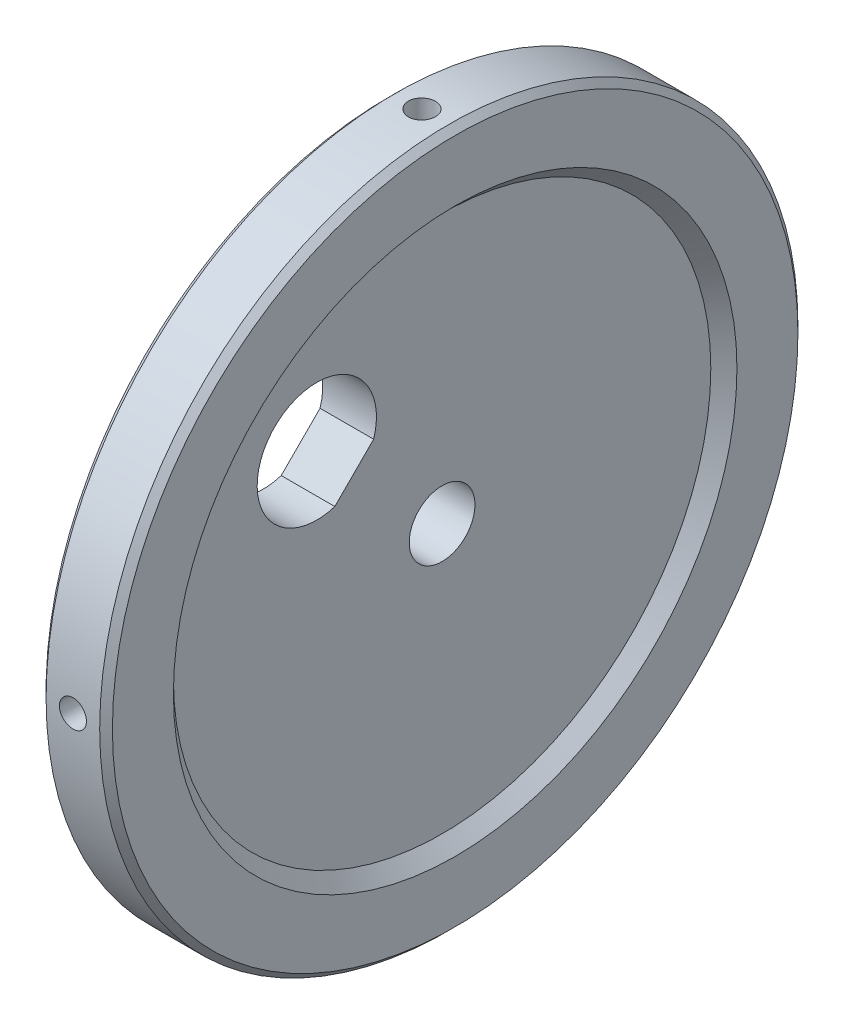
ISO-10303-21;
HEADER;
FILE_DESCRIPTION(('STEP AP214'),'2;1');
FILE_NAME('part.step','',(''),(''),'','','');
FILE_SCHEMA(('AUTOMOTIVE_DESIGN { 1 0 10303 214 1 1 1 1 }'));
ENDSEC;
DATA;
#1=APPLICATION_CONTEXT('core data for automotive mechanical design processes');
#2=APPLICATION_PROTOCOL_DEFINITION('international standard','automotive_design',2000,#1);
#3=PRODUCT_CONTEXT('',#1,'mechanical');
#4=PRODUCT('Part','Part','',(#3));
#5=PRODUCT_RELATED_PRODUCT_CATEGORY('part','',(#4));
#6=PRODUCT_DEFINITION_FORMATION('','',#4);
#7=PRODUCT_DEFINITION_CONTEXT('part definition',#1,'design');
#8=PRODUCT_DEFINITION('design','',#6,#7);
#9=PRODUCT_DEFINITION_SHAPE('','',#8);
#10=(LENGTH_UNIT() NAMED_UNIT(*) SI_UNIT(.MILLI.,.METRE.));
#11=(NAMED_UNIT(*) PLANE_ANGLE_UNIT() SI_UNIT($,.RADIAN.));
#12=(NAMED_UNIT(*) SI_UNIT($,.STERADIAN.) SOLID_ANGLE_UNIT());
#13=UNCERTAINTY_MEASURE_WITH_UNIT(LENGTH_MEASURE(1.E-05),#10,'distance_accuracy_value','');
#14=(GEOMETRIC_REPRESENTATION_CONTEXT(3) GLOBAL_UNCERTAINTY_ASSIGNED_CONTEXT((#13)) GLOBAL_UNIT_ASSIGNED_CONTEXT((#10,
#11,#12)) REPRESENTATION_CONTEXT('',''));
#15=CARTESIAN_POINT('',(0.,0.,0.));
#16=DIRECTION('',(0.,0.,1.));
#17=DIRECTION('',(1.,0.,0.));
#18=AXIS2_PLACEMENT_3D('',#15,#16,#17);
#19=CARTESIAN_POINT('',(8.,0.,0.));
#20=DIRECTION('',(1.,0.,0.));
#21=DIRECTION('',(0.,0.,-1.));
#22=AXIS2_PLACEMENT_3D('',#19,#20,#21);
#23=CONICAL_SURFACE('',#22,40.0992,0.785398163397455);
#24=CARTESIAN_POINT('',(8.,0.,0.));
#25=DIRECTION('',(-1.,0.,0.));
#26=DIRECTION('',(0.,0.,1.));
#27=AXIS2_PLACEMENT_3D('',#24,#25,#26);
#28=CIRCLE('',#27,40.0992);
#29=CARTESIAN_POINT('',(8.,0.,40.0992));
#30=VERTEX_POINT('',#29);
#31=EDGE_CURVE('E115',#30,#30,#28,.T.);
#32=ORIENTED_EDGE('',*,*,#31,.T.);
#33=EDGE_LOOP('',(#32));
#34=FACE_BOUND('',#33,.T.);
#35=CARTESIAN_POINT('',(9.9492,0.,0.));
#36=DIRECTION('',(1.,0.,0.));
#37=DIRECTION('',(0.,0.,-1.));
#38=AXIS2_PLACEMENT_3D('',#35,#36,#37);
#39=CIRCLE('',#38,42.0484);
#40=CARTESIAN_POINT('',(9.9492,0.,-42.0484));
#41=VERTEX_POINT('',#40);
#42=EDGE_CURVE('E93',#41,#41,#39,.F.);
#43=ORIENTED_EDGE('',*,*,#42,.F.);
#44=EDGE_LOOP('',(#43));
#45=FACE_BOUND('',#44,.T.);
#46=ADVANCED_FACE('F42',(#34,#45),#23,.F.);
#47=CARTESIAN_POINT('',(8.99999999999998,0.,0.));
#48=DIRECTION('',(-1.,0.,0.));
#49=DIRECTION('',(0.,0.,1.));
#50=AXIS2_PLACEMENT_3D('',#47,#48,#49);
#51=CONICAL_SURFACE('',#50,52.0992,0.785398163397448);
#52=CARTESIAN_POINT('',(8.99999999999998,0.,0.));
#53=DIRECTION('',(-1.,0.,0.));
#54=DIRECTION('',(0.,0.,1.));
#55=AXIS2_PLACEMENT_3D('',#52,#53,#54);
#56=CIRCLE('',#55,52.0992);
#57=CARTESIAN_POINT('',(8.99999999999998,0.,52.0992));
#58=VERTEX_POINT('',#57);
#59=EDGE_CURVE('E261',#58,#58,#56,.T.);
#60=ORIENTED_EDGE('',*,*,#59,.F.);
#61=EDGE_LOOP('',(#60));
#62=FACE_BOUND('',#61,.T.);
#63=CARTESIAN_POINT('',(9.9492,0.,0.));
#64=DIRECTION('',(1.,0.,0.));
#65=DIRECTION('',(0.,0.,-1.));
#66=AXIS2_PLACEMENT_3D('',#63,#64,#65);
#67=CIRCLE('',#66,51.15);
#68=CARTESIAN_POINT('',(9.9492,0.,-51.15));
#69=VERTEX_POINT('',#68);
#70=EDGE_CURVE('E46',#69,#69,#67,.F.);
#71=ORIENTED_EDGE('',*,*,#70,.T.);
#72=EDGE_LOOP('',(#71));
#73=FACE_BOUND('',#72,.T.);
#74=ADVANCED_FACE('F173',(#62,#73),#51,.T.);
#75=CARTESIAN_POINT('',(0.,0.,0.));
#76=DIRECTION('',(-1.,0.,0.));
#77=DIRECTION('',(0.,0.,1.));
#78=AXIS2_PLACEMENT_3D('',#75,#76,#77);
#79=CYLINDRICAL_SURFACE('',#78,4.9022);
#80=CARTESIAN_POINT('',(8.,0.,0.));
#81=DIRECTION('',(-1.,0.,0.));
#82=DIRECTION('',(0.,0.,1.));
#83=AXIS2_PLACEMENT_3D('',#80,#81,#82);
#84=CIRCLE('',#83,4.9022);
#85=CARTESIAN_POINT('',(8.,0.,4.9022));
#86=VERTEX_POINT('',#85);
#87=EDGE_CURVE('E118',#86,#86,#84,.T.);
#88=ORIENTED_EDGE('',*,*,#87,.F.);
#89=EDGE_LOOP('',(#88));
#90=FACE_BOUND('',#89,.T.);
#91=CARTESIAN_POINT('',(0.,0.,0.));
#92=DIRECTION('',(-1.,0.,0.));
#93=DIRECTION('',(0.,0.,1.));
#94=AXIS2_PLACEMENT_3D('',#91,#92,#93);
#95=CIRCLE('',#94,4.9022);
#96=CARTESIAN_POINT('',(0.,0.,4.9022));
#97=VERTEX_POINT('',#96);
#98=EDGE_CURVE('E111',#97,#97,#95,.T.);
#99=ORIENTED_EDGE('',*,*,#98,.T.);
#100=EDGE_LOOP('',(#99));
#101=FACE_BOUND('',#100,.T.);
#102=ADVANCED_FACE('F178',(#90,#101),#79,.F.);
#103=CARTESIAN_POINT('',(8.,0.,-4.9022));
#104=DIRECTION('',(-1.,0.,0.));
#105=DIRECTION('',(0.,0.,1.));
#106=AXIS2_PLACEMENT_3D('',#103,#104,#105);
#107=PLANE('',#106);
#108=CARTESIAN_POINT('',(8.,18.7,18.7));
#109=DIRECTION('',(1.,0.,0.));
#110=DIRECTION('',(0.,0.,-1.));
#111=AXIS2_PLACEMENT_3D('',#108,#109,#110);
#112=CIRCLE('',#111,8.89999999999999);
#113=CARTESIAN_POINT('',(8.,16.0121317778642,10.2155810793884));
#114=VERTEX_POINT('',#113);
#115=CARTESIAN_POINT('',(8.,10.2155810793884,16.0121317778641));
#116=VERTEX_POINT('',#115);
#117=EDGE_CURVE('E106',#114,#116,#112,.T.);
#118=ORIENTED_EDGE('',*,*,#117,.F.);
#119=DIRECTION('',(0.,0.707106781186548,-0.707106781186547));
#120=VECTOR('',#119,1.);
#121=CARTESIAN_POINT('',(8.,10.2155810793884,16.0121317778641));
#122=LINE('',#121,#120);
#123=EDGE_CURVE('E58',#116,#114,#122,.T.);
#124=ORIENTED_EDGE('',*,*,#123,.F.);
#125=EDGE_LOOP('',(#118,#124));
#126=FACE_BOUND('',#125,.T.);
#127=ORIENTED_EDGE('',*,*,#31,.F.);
#128=EDGE_LOOP('',(#127));
#129=FACE_BOUND('',#128,.T.);
#130=ORIENTED_EDGE('',*,*,#87,.T.);
#131=EDGE_LOOP('',(#130));
#132=FACE_BOUND('',#131,.T.);
#133=ADVANCED_FACE('F168',(#126,#129,#132),#107,.F.);
#134=CARTESIAN_POINT('',(0.,0.,0.));
#135=DIRECTION('',(-1.,0.,0.));
#136=DIRECTION('',(0.,0.,1.));
#137=AXIS2_PLACEMENT_3D('',#134,#135,#136);
#138=CYLINDRICAL_SURFACE('',#137,52.0992);
#139=CARTESIAN_POINT('',(1.00000000000001,0.,0.));
#140=DIRECTION('',(1.,0.,0.));
#141=DIRECTION('',(0.,0.,-1.));
#142=AXIS2_PLACEMENT_3D('',#139,#140,#141);
#143=CIRCLE('',#142,52.0992);
#144=CARTESIAN_POINT('',(1.00000000000001,0.,-52.0992));
#145=VERTEX_POINT('',#144);
#146=EDGE_CURVE('E11',#145,#145,#143,.T.);
#147=ORIENTED_EDGE('',*,*,#146,.T.);
#148=EDGE_LOOP('',(#147));
#149=FACE_BOUND('',#148,.T.);
#150=ORIENTED_EDGE('',*,*,#59,.T.);
#151=EDGE_LOOP('',(#150));
#152=FACE_BOUND('',#151,.T.);
#153=CARTESIAN_POINT('',(5.,52.0600525177414,2.01930000000054));
#154=CARTESIAN_POINT('',(4.8866207468725,52.0600530450892,2.01929498620389));
#155=CARTESIAN_POINT('',(4.77316036736925,52.0604268826738,2.00971894677766));
#156=CARTESIAN_POINT('',(4.54936750251875,52.0618821635881,1.97165286754928));
#157=CARTESIAN_POINT('',(4.43903889699691,52.062964447807,1.94314035054842));
#158=CARTESIAN_POINT('',(4.22478396200789,52.0657138399297,1.86801703491167));
#159=CARTESIAN_POINT('',(4.12085448062682,52.0673806571663,1.82141523019927));
#160=CARTESIAN_POINT('',(3.9223222845253,52.0711109287094,1.71144944131902));
#161=CARTESIAN_POINT('',(3.82771732891231,52.0731742873648,1.648089498056));
#162=CARTESIAN_POINT('',(3.6504279577562,52.0774667273506,1.50635796041795));
#163=CARTESIAN_POINT('',(3.56775041573732,52.0796959031255,1.42797777027524));
#164=CARTESIAN_POINT('',(3.41672104808395,52.0840678775856,1.25844691832802));
#165=CARTESIAN_POINT('',(3.34836979827619,52.086210672796,1.16729574345592));
#166=CARTESIAN_POINT('',(3.22791785916365,52.0901689859155,0.974778894937061));
#167=CARTESIAN_POINT('',(3.17582199135989,52.091984406655,0.873410202450456));
#168=CARTESIAN_POINT('',(3.08939073143921,52.0950824903863,0.663357169035168));
#169=CARTESIAN_POINT('',(3.05505524435175,52.0963651562268,0.554672867228937));
#170=CARTESIAN_POINT('',(3.00513609953419,52.0982525783441,0.33313213193188));
#171=CARTESIAN_POINT('',(2.98954294335229,52.0988576779949,0.220277841671938));
#172=CARTESIAN_POINT('',(2.97752180285846,52.0993229172599,-0.00644800571511762));
#173=CARTESIAN_POINT('',(2.98109371408022,52.0991830609346,-0.120319557293894));
#174=CARTESIAN_POINT('',(3.00729337173398,52.0981744428392,-0.345783210723619));
#175=CARTESIAN_POINT('',(3.02991088211266,52.0973060726097,-0.457376504032904));
#176=CARTESIAN_POINT('',(3.09354385901612,52.0949387239473,-0.675181139498345));
#177=CARTESIAN_POINT('',(3.13455937987376,52.0934397436522,-0.781392465759484));
#178=CARTESIAN_POINT('',(3.23383581686673,52.0899794076385,-0.985451192834155));
#179=CARTESIAN_POINT('',(3.29210141396205,52.0880179264455,-1.08329631410409));
#180=CARTESIAN_POINT('',(3.4242206111948,52.0838535823695,-1.26782021161849));
#181=CARTESIAN_POINT('',(3.4980742749963,52.0816507185006,-1.35449894225535));
#182=CARTESIAN_POINT('',(3.65933108043952,52.0772500866206,-1.51428924305249));
#183=CARTESIAN_POINT('',(3.74674310207168,52.0750523229142,-1.58739185214346));
#184=CARTESIAN_POINT('',(3.93260404740633,52.0709111239022,-1.71788579237552));
#185=CARTESIAN_POINT('',(4.03105297327815,52.0689676886465,-1.7752771204285));
#186=CARTESIAN_POINT('',(4.2361983060788,52.0655544004731,-1.87271847045469));
#187=CARTESIAN_POINT('',(4.34289485949403,52.0640845559692,-1.91276818433945));
#188=CARTESIAN_POINT('',(4.56150438061203,52.0617845335306,-1.97438359233618));
#189=CARTESIAN_POINT('',(4.67341732469697,52.0609543527001,-1.99594937012779));
#190=CARTESIAN_POINT('',(4.89920482770161,52.0600277998664,-2.01997370443167));
#191=CARTESIAN_POINT('',(5.01307806284899,52.0599309507378,-2.02244468455957));
#192=CARTESIAN_POINT('',(5.23962222999887,52.0604807371642,-2.00824167411261));
#193=CARTESIAN_POINT('',(5.3522931643649,52.0611273712573,-1.99156772118064));
#194=CARTESIAN_POINT('',(5.57319966254625,52.0630907990412,-1.93955845187132));
#195=CARTESIAN_POINT('',(5.68143656117732,52.0644073894234,-1.904228796731));
#196=CARTESIAN_POINT('',(5.89044357751691,52.0675621482116,-1.81591673665492));
#197=CARTESIAN_POINT('',(5.9912136695534,52.0694003184108,-1.76293427102951));
#198=CARTESIAN_POINT('',(6.18248378100606,52.0733921983517,-1.64078859619578));
#199=CARTESIAN_POINT('',(6.27297845862743,52.0755460708942,-1.57161702757118));
#200=CARTESIAN_POINT('',(6.44107524361355,52.0799259894302,-1.41906892407038));
#201=CARTESIAN_POINT('',(6.51867729947205,52.0821520357121,-1.33569233244755));
#202=CARTESIAN_POINT('',(6.65882757809871,52.086426767253,-1.15704766934583));
#203=CARTESIAN_POINT('',(6.72136778511572,52.0884753577022,-1.06177330677781));
#204=CARTESIAN_POINT('',(6.82956429170069,52.0921629164926,-0.862069552146122));
#205=CARTESIAN_POINT('',(6.875220642716,52.0938018860819,-0.75764018798015));
#206=CARTESIAN_POINT('',(6.94833936751069,52.0964850112921,-0.542620866292809));
#207=CARTESIAN_POINT('',(6.97580690923598,52.0975293358563,-0.432032668356704));
#208=CARTESIAN_POINT('',(7.01178524893219,52.0989061301443,-0.207810078038755));
#209=CARTESIAN_POINT('',(7.02029609749367,52.0992386017678,-0.0941756937872216));
#210=CARTESIAN_POINT('',(7.01811887845889,52.0991542270924,0.132833777724717));
#211=CARTESIAN_POINT('',(7.00744341226185,52.0987378726158,0.246208986243673));
#212=CARTESIAN_POINT('',(6.96722258054421,52.0972037103218,0.469556482071616));
#213=CARTESIAN_POINT('',(6.93767717824032,52.0960859011371,0.579528762746814));
#214=CARTESIAN_POINT('',(6.8605573849122,52.0932746804358,0.792952261997417));
#215=CARTESIAN_POINT('',(6.81298274026261,52.0915812608219,0.896403388812982));
#216=CARTESIAN_POINT('',(6.70115793118229,52.0878094902508,1.09384918343104));
#217=CARTESIAN_POINT('',(6.63690833539057,52.0857311524206,1.1878441735493));
#218=CARTESIAN_POINT('',(6.49351528900034,52.0814221382519,1.36377058900141));
#219=CARTESIAN_POINT('',(6.41436367402569,52.0791913788349,1.44569535735035));
#220=CARTESIAN_POINT('',(6.2434071684649,52.0748292754875,1.59511770967251));
#221=CARTESIAN_POINT('',(6.15159915720634,52.0726979562499,1.66261172496982));
#222=CARTESIAN_POINT('',(5.95788646398792,52.0687741007073,1.7812756701454));
#223=CARTESIAN_POINT('',(5.85597411619854,52.0669818246675,1.83243307985102));
#224=CARTESIAN_POINT('',(5.64507780982847,52.0639426382332,1.91685126877113));
#225=CARTESIAN_POINT('',(5.53610242753433,52.0626950801523,1.95013331324013));
#226=CARTESIAN_POINT('',(5.35536905442173,52.0612183093378,1.98906979987805));
#227=CARTESIAN_POINT('',(5.28478327524934,52.0607830475699,2.0003917823503));
#228=CARTESIAN_POINT('',(5.14280906097432,52.0601999857485,2.01550845968903));
#229=CARTESIAN_POINT('',(5.07142062627369,52.060052185551,2.01930315832526));
#230=CARTESIAN_POINT('',(5.,52.0600525177414,2.01930000000054));
#231=B_SPLINE_CURVE_WITH_KNOTS('',3,(#153,#154,#155,#156,#157,#158,#159,#160,#161,#162,#163,
#164,#165,#166,#167,#168,#169,#170,#171,#172,#173,#174,#175,#176,#177,#178,#179,#180,#181,#182,
#183,#184,#185,#186,#187,#188,#189,#190,#191,#192,#193,#194,#195,#196,#197,#198,#199,#200,#201,
#202,#203,#204,#205,#206,#207,#208,#209,#210,#211,#212,#213,#214,#215,#216,#217,#218,#219,#220,
#221,#222,#223,#224,#225,#226,#227,#228,#229,#230),.UNSPECIFIED.,.T.,.F.,(4,2,2,2,2,2,2,2,2,2,2,
2,2,2,2,2,2,2,2,2,2,2,2,2,2,2,2,2,2,2,2,2,2,2,2,2,2,2,4),(0.,0.3398770580213,0.680158265669201,
1.02027050308574,1.3603008035866,1.70052628046743,2.04076542964899,2.38110540127972,
2.72144355298315,3.06160915142128,3.40177289566254,3.74175393556873,4.08173597951105,
4.42181036526536,4.76188613996314,5.10218559376563,5.44248511445501,5.78279068060533,
6.1230947061318,6.46317730157388,6.80325922834464,7.14323801351931,7.48321796753938,
7.82337386267209,8.16353111670118,8.50386900063764,8.84420584751096,9.18444595369512,
9.52468515186438,9.86470096564277,10.2047174422182,10.5447387021337,10.8847483683747,
11.2249448608237,11.5652253856444,11.9057660748489,12.2459007407178,12.4599985039956,
12.6740961600513),.UNSPECIFIED.);
#232=CARTESIAN_POINT('',(5.,52.0600525177414,2.01930000000054));
#233=VERTEX_POINT('',#232);
#234=EDGE_CURVE('E255',#233,#233,#231,.T.);
#235=ORIENTED_EDGE('',*,*,#234,.T.);
#236=EDGE_LOOP('',(#235));
#237=FACE_BOUND('',#236,.T.);
#238=CARTESIAN_POINT('',(2.9807,0.,-52.0992));
#239=CARTESIAN_POINT('',(2.98070501376385,-0.113379289199854,-52.0991994741454));
#240=CARTESIAN_POINT('',(2.99028105907726,-0.226839704651487,-52.0988259247587));
#241=CARTESIAN_POINT('',(3.02834716381731,-0.450632644196927,-52.0973716731606));
#242=CARTESIAN_POINT('',(3.05685970032083,-0.560961288493453,-52.0962901306034));
#243=CARTESIAN_POINT('',(3.13198307301948,-0.775216305442052,-52.0935423483804));
#244=CARTESIAN_POINT('',(3.17858491622204,-0.879145829679516,-52.0918763992884));
#245=CARTESIAN_POINT('',(3.28855079571916,-1.07767809746716,-52.0881476104589));
#246=CARTESIAN_POINT('',(3.35191079101323,-1.1722830819643,-52.0860848664357));
#247=CARTESIAN_POINT('',(3.49364238100329,-1.34957242000901,-52.0817931354038));
#248=CARTESIAN_POINT('',(3.57202255986335,-1.43224990929976,-52.0795640537786));
#249=CARTESIAN_POINT('',(3.74155336717263,-1.5832791753285,-52.0751917037809));
#250=CARTESIAN_POINT('',(3.8327045088325,-1.65163037607827,-52.0730484388614));
#251=CARTESIAN_POINT('',(4.02522132874504,-1.77208226427676,-52.0690888271124));
#252=CARTESIAN_POINT('',(4.12659003154412,-1.82417812110665,-52.0672725775299));
#253=CARTESIAN_POINT('',(4.33664308738492,-1.91060935788658,-52.0641728415249));
#254=CARTESIAN_POINT('',(4.44532740124922,-1.94494483294059,-52.0628893522494));
#255=CARTESIAN_POINT('',(4.66686817146418,-1.99486395204049,-52.0610006504351));
#256=CARTESIAN_POINT('',(4.77972248477464,-2.01045709368167,-52.0603950943673));
#257=CARTESIAN_POINT('',(5.00644837714598,-2.02247819710955,-52.0599295090511));
#258=CARTESIAN_POINT('',(5.12031995065041,-2.01890626351558,-52.060069475733));
#259=CARTESIAN_POINT('',(5.34578350429339,-1.99270657085942,-52.0610788325293));
#260=CARTESIAN_POINT('',(5.45737667851556,-1.97008907035977,-52.061947829963));
#261=CARTESIAN_POINT('',(5.67518108089367,-1.90645615465727,-52.064316674707));
#262=CARTESIAN_POINT('',(5.78139229309028,-1.86544068490178,-52.0658165238879));
#263=CARTESIAN_POINT('',(5.98545088352293,-1.76616435285139,-52.0692784604796));
#264=CARTESIAN_POINT('',(6.08329597633979,-1.7078987975302,-52.0712406736507));
#265=CARTESIAN_POINT('',(6.26781983474721,-1.57577968899336,-52.0754060230612));
#266=CARTESIAN_POINT('',(6.35449855474935,-1.50192607214033,-52.0776091602841));
#267=CARTESIAN_POINT('',(6.5142889101353,-1.34066929948842,-52.0820097622879));
#268=CARTESIAN_POINT('',(6.58739157492686,-1.25325725424615,-52.0842072223786));
#269=CARTESIAN_POINT('',(6.7178856162171,-1.06739624201379,-52.08834736815));
#270=CARTESIAN_POINT('',(6.77527698973898,-0.968947272932541,-52.0902900537823));
#271=CARTESIAN_POINT('',(6.87271837229114,-0.763801929522281,-52.0937017240383));
#272=CARTESIAN_POINT('',(6.91276808746272,-0.657105415472671,-52.0951707006347));
#273=CARTESIAN_POINT('',(6.97438351014412,-0.438495979754545,-52.097469251256));
#274=CARTESIAN_POINT('',(6.99594930110131,-0.326583081638279,-52.0982988281674));
#275=CARTESIAN_POINT('',(7.0199736848836,-0.100795598264273,-52.0992247030253));
#276=CARTESIAN_POINT('',(7.02244468878413,0.013077664557498,-52.099321477272));
#277=CARTESIAN_POINT('',(7.00824171599964,0.239621892805347,-52.0987721017075));
#278=CARTESIAN_POINT('',(6.99156777696025,0.352292860595116,-52.0981259533571));
#279=CARTESIAN_POINT('',(6.93955850206635,0.573199516179375,-52.0961638442002));
#280=CARTESIAN_POINT('',(6.90422881346126,0.681436535488253,-52.0948480860945));
#281=CARTESIAN_POINT('',(6.81591664593062,0.890443778329162,-52.0916949741398));
#282=CARTESIAN_POINT('',(6.76293410651075,0.991213976271788,-52.0898576185034));
#283=CARTESIAN_POINT('',(6.64078832460532,1.18248415717511,-52.085866996215));
#284=CARTESIAN_POINT('',(6.57161674148298,1.27297881033533,-52.083713566935));
#285=CARTESIAN_POINT('',(6.4190686227463,1.44107553919149,-52.0793339669989));
#286=CARTESIAN_POINT('',(6.33569203027089,1.51867756327722,-52.0771077960517));
#287=CARTESIAN_POINT('',(6.15704738158549,1.65882777709757,-52.0728323018158));
#288=CARTESIAN_POINT('',(6.06177303433035,1.72136795112577,-52.0707830730637));
#289=CARTESIAN_POINT('',(5.86206931875696,1.82956439974603,-52.0670940035048));
#290=CARTESIAN_POINT('',(5.75763997833615,1.87522072578496,-52.0654541614505));
#291=CARTESIAN_POINT('',(5.54262063852826,1.9483394331891,-52.0627694393838));
#292=CARTESIAN_POINT('',(5.43203239505199,1.97580697170372,-52.0617243907388));
#293=CARTESIAN_POINT('',(5.20780970900095,2.01178528953384,-52.0603466150692));
#294=CARTESIAN_POINT('',(5.0941752745952,2.02029611968067,-52.0600138861346));
#295=CARTESIAN_POINT('',(4.86716583780286,2.018118848581,-52.0600983261785));
#296=CARTESIAN_POINT('',(4.75379071394361,2.00744337061282,-52.0605150020999));
#297=CARTESIAN_POINT('',(4.53044339027454,1.96722254521402,-52.0620502440303));
#298=CARTESIAN_POINT('',(4.42047119712599,1.93767716084791,-52.0631688114132));
#299=CARTESIAN_POINT('',(4.20704786744977,1.86055743457974,-52.0659816533717));
#300=CARTESIAN_POINT('',(4.10359682270137,1.81298283899892,-52.067675936048));
#301=CARTESIAN_POINT('',(3.9061511716229,1.70115815332432,-52.0714491595119));
#302=CARTESIAN_POINT('',(3.81215624302735,1.63690863178118,-52.073528087184));
#303=CARTESIAN_POINT('',(3.63622981960488,1.49351566521973,-52.0778377524744));
#304=CARTESIAN_POINT('',(3.55430499548744,1.41436403897868,-52.0800685730499));
#305=CARTESIAN_POINT('',(3.40488253592995,1.24340748819891,-52.0844302404222));
#306=CARTESIAN_POINT('',(3.33738846902258,1.15159944310797,-52.0865610623892));
#307=CARTESIAN_POINT('',(3.21872447038251,0.957886724208498,-52.0904835811696));
#308=CARTESIAN_POINT('',(3.16756704899224,0.855974390583557,-52.0922750176621));
#309=CARTESIAN_POINT('',(3.08314883426087,0.645078114611625,-52.0953125542212));
#310=CARTESIAN_POINT('',(3.04986677585147,0.53610274847327,-52.0965593019349));
#311=CARTESIAN_POINT('',(3.01093024860314,0.355369337861915,-52.0980350625457));
#312=CARTESIAN_POINT('',(2.9996082478959,0.284783502167719,-52.0984700094571));
#313=CARTESIAN_POINT('',(2.98449154632169,0.142809174566551,-52.0990526437375));
#314=CARTESIAN_POINT('',(2.98069684169445,0.0714206830605651,-52.09920033125));
#315=CARTESIAN_POINT('',(2.9807,0.,-52.0992));
#316=B_SPLINE_CURVE_WITH_KNOTS('',3,(#238,#239,#240,#241,#242,#243,#244,#245,#246,#247,#248,
#249,#250,#251,#252,#253,#254,#255,#256,#257,#258,#259,#260,#261,#262,#263,#264,#265,#266,#267,
#268,#269,#270,#271,#272,#273,#274,#275,#276,#277,#278,#279,#280,#281,#282,#283,#284,#285,#286,
#287,#288,#289,#290,#291,#292,#293,#294,#295,#296,#297,#298,#299,#300,#301,#302,#303,#304,#305,
#306,#307,#308,#309,#310,#311,#312,#313,#314,#315),.UNSPECIFIED.,.T.,.F.,(4,2,2,2,2,2,2,2,2,2,2,
2,2,2,2,2,2,2,2,2,2,2,2,2,2,2,2,2,2,2,2,2,2,2,2,2,2,2,4),(0.,0.339877166352468,
0.680158479974486,1.02027084095649,1.36030126312113,1.70052659829699,2.04076560960459,
2.38110563403806,2.72144383598685,3.06160950023442,3.40177330756956,3.74175400871313,
4.08173571795526,4.42181000712035,4.76188568464641,5.1021852791673,5.44248493816442,
5.7827903633982,6.1230942522839,6.46317693457754,6.80325894815133,7.1432380750568,
7.48321836704448,7.8233742048373,8.16353140426796,8.50386923255661,8.84420602379134,
9.18444627642759,9.52468561672774,9.86470118475809,10.2047174183286,10.5447384362516,
10.8847478622923,11.2249444999631,11.5652251666484,11.9057657934108,12.2459004004233,
12.4599983337861,12.6740961601959),.UNSPECIFIED.);
#317=CARTESIAN_POINT('',(2.9807,0.,-52.0992));
#318=VERTEX_POINT('',#317);
#319=EDGE_CURVE('E262',#318,#318,#316,.T.);
#320=ORIENTED_EDGE('',*,*,#319,.T.);
#321=EDGE_LOOP('',(#320));
#322=FACE_BOUND('',#321,.T.);
#323=CARTESIAN_POINT('',(5.,-52.0600525177415,-2.01930000000018));
#324=CARTESIAN_POINT('',(4.8866207468725,-52.0600530450892,-2.01929498620353));
#325=CARTESIAN_POINT('',(4.77316036736925,-52.0604268826738,-2.00971894677729));
#326=CARTESIAN_POINT('',(4.54936750251875,-52.0618821635881,-1.97165286754891));
#327=CARTESIAN_POINT('',(4.43903889699691,-52.062964447807,-1.94314035054806));
#328=CARTESIAN_POINT('',(4.22478396200789,-52.0657138399297,-1.86801703491131));
#329=CARTESIAN_POINT('',(4.12085448062682,-52.0673806571663,-1.82141523019891));
#330=CARTESIAN_POINT('',(3.9223222845253,-52.0711109287094,-1.71144944131866));
#331=CARTESIAN_POINT('',(3.82771732891231,-52.0731742873648,-1.64808949805564));
#332=CARTESIAN_POINT('',(3.6504279577562,-52.0774667273506,-1.50635796041758));
#333=CARTESIAN_POINT('',(3.56775041573732,-52.0796959031255,-1.42797777027488));
#334=CARTESIAN_POINT('',(3.41672104808395,-52.0840678775856,-1.25844691832766));
#335=CARTESIAN_POINT('',(3.34836979827619,-52.086210672796,-1.16729574345555));
#336=CARTESIAN_POINT('',(3.22791785916365,-52.0901689859155,-0.974778894936698));
#337=CARTESIAN_POINT('',(3.17582199135989,-52.0919844066551,-0.873410202450093));
#338=CARTESIAN_POINT('',(3.08939073143921,-52.0950824903863,-0.663357169034804));
#339=CARTESIAN_POINT('',(3.05505524435175,-52.0963651562268,-0.554672867228574));
#340=CARTESIAN_POINT('',(3.00513609953419,-52.0982525783441,-0.333132131931516));
#341=CARTESIAN_POINT('',(2.98954294335229,-52.0988576779949,-0.220277841671575));
#342=CARTESIAN_POINT('',(2.97752180285846,-52.0993229172599,0.00644800571548154));
#343=CARTESIAN_POINT('',(2.98109371408022,-52.0991830609346,0.120319557294258));
#344=CARTESIAN_POINT('',(3.00729337173398,-52.0981744428392,0.345783210723983));
#345=CARTESIAN_POINT('',(3.02991088211266,-52.0973060726097,0.457376504033268));
#346=CARTESIAN_POINT('',(3.09354385901612,-52.0949387239473,0.675181139498709));
#347=CARTESIAN_POINT('',(3.13455937987376,-52.0934397436522,0.781392465759848));
#348=CARTESIAN_POINT('',(3.23383581686673,-52.0899794076385,0.985451192834519));
#349=CARTESIAN_POINT('',(3.29210141396205,-52.0880179264455,1.08329631410445));
#350=CARTESIAN_POINT('',(3.4242206111948,-52.0838535823695,1.26782021161885));
#351=CARTESIAN_POINT('',(3.4980742749963,-52.0816507185006,1.35449894225572));
#352=CARTESIAN_POINT('',(3.65933108043952,-52.0772500866206,1.51428924305285));
#353=CARTESIAN_POINT('',(3.74674310207168,-52.0750523229142,1.58739185214383));
#354=CARTESIAN_POINT('',(3.93260404740633,-52.0709111239021,1.71788579237588));
#355=CARTESIAN_POINT('',(4.03105297327815,-52.0689676886465,1.77527712042886));
#356=CARTESIAN_POINT('',(4.2361983060788,-52.0655544004731,1.87271847045505));
#357=CARTESIAN_POINT('',(4.34289485949403,-52.0640845559692,1.91276818433981));
#358=CARTESIAN_POINT('',(4.56150438061203,-52.0617845335306,1.97438359233655));
#359=CARTESIAN_POINT('',(4.67341732469697,-52.0609543527,1.99594937012815));
#360=CARTESIAN_POINT('',(4.89920482770161,-52.0600277998664,2.01997370443203));
#361=CARTESIAN_POINT('',(5.01307806284899,-52.0599309507378,2.02244468455993));
#362=CARTESIAN_POINT('',(5.23962222999887,-52.0604807371642,2.00824167411297));
#363=CARTESIAN_POINT('',(5.3522931643649,-52.0611273712573,1.991567721181));
#364=CARTESIAN_POINT('',(5.57319966254625,-52.0630907990412,1.93955845187169));
#365=CARTESIAN_POINT('',(5.68143656117732,-52.0644073894234,1.90422879673137));
#366=CARTESIAN_POINT('',(5.89044357751691,-52.0675621482116,1.81591673665529));
#367=CARTESIAN_POINT('',(5.9912136695534,-52.0694003184108,1.76293427102988));
#368=CARTESIAN_POINT('',(6.18248378100606,-52.0733921983517,1.64078859619614));
#369=CARTESIAN_POINT('',(6.27297845862743,-52.0755460708942,1.57161702757154));
#370=CARTESIAN_POINT('',(6.44107524361355,-52.0799259894302,1.41906892407075));
#371=CARTESIAN_POINT('',(6.51867729947205,-52.0821520357121,1.33569233244792));
#372=CARTESIAN_POINT('',(6.65882757809871,-52.086426767253,1.15704766934619));
#373=CARTESIAN_POINT('',(6.72136778511572,-52.0884753577022,1.06177330677818));
#374=CARTESIAN_POINT('',(6.82956429170069,-52.0921629164926,0.862069552146486));
#375=CARTESIAN_POINT('',(6.875220642716,-52.0938018860819,0.757640187980514));
#376=CARTESIAN_POINT('',(6.94833936751069,-52.0964850112921,0.542620866293173));
#377=CARTESIAN_POINT('',(6.97580690923598,-52.0975293358563,0.432032668357068));
#378=CARTESIAN_POINT('',(7.01178524893219,-52.0989061301443,0.207810078039119));
#379=CARTESIAN_POINT('',(7.02029609749367,-52.0992386017678,0.0941756937875858));
#380=CARTESIAN_POINT('',(7.01811887845889,-52.0991542270924,-0.132833777724353));
#381=CARTESIAN_POINT('',(7.00744341226185,-52.0987378726158,-0.246208986243311));
#382=CARTESIAN_POINT('',(6.96722258054421,-52.0972037103218,-0.469556482071253));
#383=CARTESIAN_POINT('',(6.93767717824032,-52.0960859011371,-0.579528762746451));
#384=CARTESIAN_POINT('',(6.8605573849122,-52.0932746804358,-0.792952261997054));
#385=CARTESIAN_POINT('',(6.81298274026261,-52.0915812608219,-0.896403388812619));
#386=CARTESIAN_POINT('',(6.70115793118229,-52.0878094902508,-1.09384918343068));
#387=CARTESIAN_POINT('',(6.63690833539057,-52.0857311524206,-1.18784417354894));
#388=CARTESIAN_POINT('',(6.49351528900034,-52.0814221382519,-1.36377058900104));
#389=CARTESIAN_POINT('',(6.41436367402569,-52.0791913788349,-1.44569535734999));
#390=CARTESIAN_POINT('',(6.2434071684649,-52.0748292754875,-1.59511770967215));
#391=CARTESIAN_POINT('',(6.15159915720634,-52.0726979562499,-1.66261172496945));
#392=CARTESIAN_POINT('',(5.95788646398792,-52.0687741007073,-1.78127567014503));
#393=CARTESIAN_POINT('',(5.85597411619854,-52.0669818246675,-1.83243307985066));
#394=CARTESIAN_POINT('',(5.64507780982847,-52.0639426382332,-1.91685126877077));
#395=CARTESIAN_POINT('',(5.53610242753433,-52.0626950801523,-1.95013331323977));
#396=CARTESIAN_POINT('',(5.35536905442173,-52.0612183093378,-1.98906979987769));
#397=CARTESIAN_POINT('',(5.28478327524934,-52.0607830475699,-2.00039178234993));
#398=CARTESIAN_POINT('',(5.14280906097432,-52.0601999857485,-2.01550845968867));
#399=CARTESIAN_POINT('',(5.07142062627369,-52.060052185551,-2.01930315832489));
#400=CARTESIAN_POINT('',(5.,-52.0600525177415,-2.01930000000018));
#401=B_SPLINE_CURVE_WITH_KNOTS('',3,(#323,#324,#325,#326,#327,#328,#329,#330,#331,#332,#333,
#334,#335,#336,#337,#338,#339,#340,#341,#342,#343,#344,#345,#346,#347,#348,#349,#350,#351,#352,
#353,#354,#355,#356,#357,#358,#359,#360,#361,#362,#363,#364,#365,#366,#367,#368,#369,#370,#371,
#372,#373,#374,#375,#376,#377,#378,#379,#380,#381,#382,#383,#384,#385,#386,#387,#388,#389,#390,
#391,#392,#393,#394,#395,#396,#397,#398,#399,#400),.UNSPECIFIED.,.T.,.F.,(4,2,2,2,2,2,2,2,2,2,2,
2,2,2,2,2,2,2,2,2,2,2,2,2,2,2,2,2,2,2,2,2,2,2,2,2,2,2,4),(0.,0.339877058021299,
0.680158265669201,1.02027050308574,1.3603008035866,1.70052628046743,2.04076542964899,
2.38110540127972,2.72144355298315,3.06160915142128,3.40177289566254,3.74175393556873,
4.08173597951105,4.42181036526535,4.76188613996314,5.10218559376563,5.44248511445501,
5.78279068060533,6.1230947061318,6.46317730157388,6.80325922834464,7.14323801351931,
7.48321796753938,7.82337386267209,8.16353111670118,8.50386900063764,8.84420584751095,
9.18444595369512,9.52468515186438,9.86470096564277,10.2047174422182,10.5447387021337,
10.8847483683746,11.2249448608237,11.5652253856444,11.9057660748489,12.2459007407178,
12.4599985039956,12.6740961600513),.UNSPECIFIED.);
#402=CARTESIAN_POINT('',(5.,-52.0600525177415,-2.01930000000018));
#403=VERTEX_POINT('',#402);
#404=EDGE_CURVE('E135',#403,#403,#401,.T.);
#405=ORIENTED_EDGE('',*,*,#404,.T.);
#406=EDGE_LOOP('',(#405));
#407=FACE_BOUND('',#406,.T.);
#408=CARTESIAN_POINT('',(7.0193,0.,52.0992));
#409=CARTESIAN_POINT('',(7.01929498623615,-0.113379289199854,52.0991994741454));
#410=CARTESIAN_POINT('',(7.00971894092274,-0.226839704651487,52.0988259247587));
#411=CARTESIAN_POINT('',(6.97165283618269,-0.450632644196927,52.0973716731606));
#412=CARTESIAN_POINT('',(6.94314029967917,-0.560961288493453,52.0962901306034));
#413=CARTESIAN_POINT('',(6.86801692698052,-0.775216305442052,52.0935423483804));
#414=CARTESIAN_POINT('',(6.82141508377796,-0.879145829679517,52.0918763992884));
#415=CARTESIAN_POINT('',(6.71144920428084,-1.07767809746716,52.0881476104589));
#416=CARTESIAN_POINT('',(6.64808920898677,-1.1722830819643,52.0860848664357));
#417=CARTESIAN_POINT('',(6.50635761899671,-1.34957242000901,52.0817931354038));
#418=CARTESIAN_POINT('',(6.42797744013665,-1.43224990929976,52.0795640537786));
#419=CARTESIAN_POINT('',(6.25844663282737,-1.5832791753285,52.0751917037809));
#420=CARTESIAN_POINT('',(6.1672954911675,-1.65163037607827,52.0730484388614));
#421=CARTESIAN_POINT('',(5.97477867125496,-1.77208226427676,52.0690888271124));
#422=CARTESIAN_POINT('',(5.87340996845588,-1.82417812110665,52.0672725775299));
#423=CARTESIAN_POINT('',(5.66335691261508,-1.91060935788658,52.0641728415249));
#424=CARTESIAN_POINT('',(5.55467259875078,-1.94494483294059,52.0628893522494));
#425=CARTESIAN_POINT('',(5.33313182853582,-1.99486395204049,52.0610006504351));
#426=CARTESIAN_POINT('',(5.22027751522536,-2.01045709368167,52.0603950943673));
#427=CARTESIAN_POINT('',(4.99355162285402,-2.02247819710955,52.0599295090511));
#428=CARTESIAN_POINT('',(4.87968004934959,-2.01890626351558,52.060069475733));
#429=CARTESIAN_POINT('',(4.65421649570661,-1.99270657085942,52.0610788325293));
#430=CARTESIAN_POINT('',(4.54262332148444,-1.97008907035977,52.061947829963));
#431=CARTESIAN_POINT('',(4.32481891910633,-1.90645615465727,52.064316674707));
#432=CARTESIAN_POINT('',(4.21860770690972,-1.86544068490178,52.0658165238879));
#433=CARTESIAN_POINT('',(4.01454911647707,-1.76616435285139,52.0692784604796));
#434=CARTESIAN_POINT('',(3.91670402366021,-1.7078987975302,52.0712406736507));
#435=CARTESIAN_POINT('',(3.73218016525279,-1.57577968899336,52.0754060230612));
#436=CARTESIAN_POINT('',(3.64550144525065,-1.50192607214033,52.0776091602841));
#437=CARTESIAN_POINT('',(3.4857110898647,-1.34066929948842,52.0820097622879));
#438=CARTESIAN_POINT('',(3.41260842507314,-1.25325725424615,52.0842072223786));
#439=CARTESIAN_POINT('',(3.2821143837829,-1.06739624201379,52.08834736815));
#440=CARTESIAN_POINT('',(3.22472301026102,-0.968947272932541,52.0902900537823));
#441=CARTESIAN_POINT('',(3.12728162770886,-0.763801929522281,52.0937017240383));
#442=CARTESIAN_POINT('',(3.08723191253729,-0.657105415472671,52.0951707006347));
#443=CARTESIAN_POINT('',(3.02561648985588,-0.438495979754545,52.097469251256));
#444=CARTESIAN_POINT('',(3.00405069889869,-0.326583081638279,52.0982988281674));
#445=CARTESIAN_POINT('',(2.9800263151164,-0.100795598264273,52.0992247030253));
#446=CARTESIAN_POINT('',(2.97755531121587,0.013077664557498,52.099321477272));
#447=CARTESIAN_POINT('',(2.99175828400036,0.239621892805347,52.0987721017075));
#448=CARTESIAN_POINT('',(3.00843222303975,0.352292860595116,52.0981259533571));
#449=CARTESIAN_POINT('',(3.06044149793365,0.573199516179375,52.0961638442002));
#450=CARTESIAN_POINT('',(3.09577118653874,0.681436535488253,52.0948480860945));
#451=CARTESIAN_POINT('',(3.18408335406938,0.890443778329162,52.0916949741398));
#452=CARTESIAN_POINT('',(3.23706589348926,0.991213976271788,52.0898576185034));
#453=CARTESIAN_POINT('',(3.35921167539468,1.18248415717511,52.085866996215));
#454=CARTESIAN_POINT('',(3.42838325851702,1.27297881033533,52.083713566935));
#455=CARTESIAN_POINT('',(3.5809313772537,1.44107553919149,52.0793339669989));
#456=CARTESIAN_POINT('',(3.66430796972911,1.51867756327722,52.0771077960517));
#457=CARTESIAN_POINT('',(3.84295261841451,1.65882777709757,52.0728323018158));
#458=CARTESIAN_POINT('',(3.93822696566965,1.72136795112577,52.0707830730637));
#459=CARTESIAN_POINT('',(4.13793068124304,1.82956439974603,52.0670940035048));
#460=CARTESIAN_POINT('',(4.24236002166385,1.87522072578495,52.0654541614505));
#461=CARTESIAN_POINT('',(4.45737936147174,1.9483394331891,52.0627694393838));
#462=CARTESIAN_POINT('',(4.56796760494801,1.97580697170372,52.0617243907388));
#463=CARTESIAN_POINT('',(4.79219029099905,2.01178528953384,52.0603466150692));
#464=CARTESIAN_POINT('',(4.9058247254048,2.02029611968067,52.0600138861346));
#465=CARTESIAN_POINT('',(5.13283416219714,2.018118848581,52.0600983261785));
#466=CARTESIAN_POINT('',(5.2462092860564,2.00744337061282,52.0605150020999));
#467=CARTESIAN_POINT('',(5.46955660972546,1.96722254521402,52.0620502440303));
#468=CARTESIAN_POINT('',(5.57952880287401,1.93767716084791,52.0631688114132));
#469=CARTESIAN_POINT('',(5.79295213255023,1.86055743457974,52.0659816533717));
#470=CARTESIAN_POINT('',(5.89640317729863,1.81298283899892,52.067675936048));
#471=CARTESIAN_POINT('',(6.0938488283771,1.70115815332431,52.0714491595119));
#472=CARTESIAN_POINT('',(6.18784375697265,1.63690863178118,52.073528087184));
#473=CARTESIAN_POINT('',(6.36377018039512,1.49351566521973,52.0778377524744));
#474=CARTESIAN_POINT('',(6.44569500451256,1.41436403897868,52.0800685730499));
#475=CARTESIAN_POINT('',(6.59511746407005,1.24340748819891,52.0844302404222));
#476=CARTESIAN_POINT('',(6.66261153097742,1.15159944310797,52.0865610623892));
#477=CARTESIAN_POINT('',(6.78127552961749,0.957886724208499,52.0904835811696));
#478=CARTESIAN_POINT('',(6.83243295100775,0.855974390583557,52.0922750176621));
#479=CARTESIAN_POINT('',(6.91685116573913,0.645078114611626,52.0953125542212));
#480=CARTESIAN_POINT('',(6.95013322414854,0.53610274847327,52.0965593019349));
#481=CARTESIAN_POINT('',(6.98906975139686,0.355369337861915,52.0980350625457));
#482=CARTESIAN_POINT('',(7.0003917521041,0.28478350216772,52.0984700094571));
#483=CARTESIAN_POINT('',(7.01550845367831,0.142809174566552,52.0990526437375));
#484=CARTESIAN_POINT('',(7.01930315830555,0.0714206830605656,52.09920033125));
#485=CARTESIAN_POINT('',(7.0193,0.,52.0992));
#486=B_SPLINE_CURVE_WITH_KNOTS('',3,(#408,#409,#410,#411,#412,#413,#414,#415,#416,#417,#418,
#419,#420,#421,#422,#423,#424,#425,#426,#427,#428,#429,#430,#431,#432,#433,#434,#435,#436,#437,
#438,#439,#440,#441,#442,#443,#444,#445,#446,#447,#448,#449,#450,#451,#452,#453,#454,#455,#456,
#457,#458,#459,#460,#461,#462,#463,#464,#465,#466,#467,#468,#469,#470,#471,#472,#473,#474,#475,
#476,#477,#478,#479,#480,#481,#482,#483,#484,#485),.UNSPECIFIED.,.T.,.F.,(4,2,2,2,2,2,2,2,2,2,2,
2,2,2,2,2,2,2,2,2,2,2,2,2,2,2,2,2,2,2,2,2,2,2,2,2,2,2,4),(0.,0.339877166352468,
0.680158479974486,1.02027084095649,1.36030126312113,1.70052659829699,2.04076560960459,
2.38110563403806,2.72144383598685,3.06160950023442,3.40177330756956,3.74175400871313,
4.08173571795526,4.42181000712035,4.76188568464641,5.1021852791673,5.44248493816442,
5.7827903633982,6.1230942522839,6.46317693457754,6.80325894815133,7.1432380750568,
7.48321836704448,7.8233742048373,8.16353140426795,8.50386923255661,8.84420602379134,
9.18444627642758,9.52468561672774,9.86470118475809,10.2047174183286,10.5447384362516,
10.8847478622923,11.2249444999631,11.5652251666484,11.9057657934108,12.2459004004233,
12.4599983337861,12.6740961601959),.UNSPECIFIED.);
#487=CARTESIAN_POINT('',(7.0193,0.,52.0992));
#488=VERTEX_POINT('',#487);
#489=EDGE_CURVE('E127',#488,#488,#486,.T.);
#490=ORIENTED_EDGE('',*,*,#489,.T.);
#491=EDGE_LOOP('',(#490));
#492=FACE_BOUND('',#491,.T.);
#493=ADVANCED_FACE('F141',(#149,#152,#237,#322,#407,#492),#138,.T.);
#494=CARTESIAN_POINT('',(0.,0.,-4.9022));
#495=DIRECTION('',(1.,0.,0.));
#496=DIRECTION('',(0.,0.,-1.));
#497=AXIS2_PLACEMENT_3D('',#494,#495,#496);
#498=PLANE('',#497);
#499=CARTESIAN_POINT('',(0.,0.,0.));
#500=DIRECTION('',(1.,0.,0.));
#501=DIRECTION('',(0.,0.,-1.));
#502=AXIS2_PLACEMENT_3D('',#499,#500,#501);
#503=CIRCLE('',#502,51.0992);
#504=CARTESIAN_POINT('',(0.,0.,-51.0992));
#505=VERTEX_POINT('',#504);
#506=EDGE_CURVE('E51',#505,#505,#503,.F.);
#507=ORIENTED_EDGE('',*,*,#506,.T.);
#508=EDGE_LOOP('',(#507));
#509=FACE_BOUND('',#508,.T.);
#510=CARTESIAN_POINT('',(0.,18.7,18.7));
#511=DIRECTION('',(1.,0.,0.));
#512=DIRECTION('',(0.,0.,-1.));
#513=AXIS2_PLACEMENT_3D('',#510,#511,#512);
#514=CIRCLE('',#513,8.89999999999999);
#515=CARTESIAN_POINT('',(0.,16.0121317778642,10.2155810793884));
#516=VERTEX_POINT('',#515);
#517=CARTESIAN_POINT('',(0.,10.2155810793884,16.0121317778641));
#518=VERTEX_POINT('',#517);
#519=EDGE_CURVE('E121',#516,#518,#514,.T.);
#520=ORIENTED_EDGE('',*,*,#519,.T.);
#521=DIRECTION('',(0.,0.707106781186548,-0.707106781186547));
#522=VECTOR('',#521,1.);
#523=CARTESIAN_POINT('',(0.,15.5649564286263,10.6627564286263));
#524=LINE('',#523,#522);
#525=EDGE_CURVE('E124',#518,#516,#524,.T.);
#526=ORIENTED_EDGE('',*,*,#525,.T.);
#527=EDGE_LOOP('',(#520,#526));
#528=FACE_BOUND('',#527,.T.);
#529=ORIENTED_EDGE('',*,*,#98,.F.);
#530=EDGE_LOOP('',(#529));
#531=FACE_BOUND('',#530,.T.);
#532=ADVANCED_FACE('F161',(#509,#528,#531),#498,.F.);
#533=CARTESIAN_POINT('',(-2.,10.2155810793884,16.0121317778641));
#534=DIRECTION('',(0.,-0.707106781186547,-0.707106781186548));
#535=DIRECTION('',(0.,0.707106781186548,-0.707106781186547));
#536=AXIS2_PLACEMENT_3D('',#533,#534,#535);
#537=PLANE('',#536);
#538=DIRECTION('',(1.,0.,0.));
#539=VECTOR('',#538,1.);
#540=CARTESIAN_POINT('',(-2.,10.2155810793884,16.0121317778641));
#541=LINE('',#540,#539);
#542=EDGE_CURVE('E65',#518,#116,#541,.T.);
#543=ORIENTED_EDGE('',*,*,#542,.T.);
#544=ORIENTED_EDGE('',*,*,#123,.T.);
#545=DIRECTION('',(1.,0.,0.));
#546=VECTOR('',#545,1.);
#547=CARTESIAN_POINT('',(-2.,16.0121317778642,10.2155810793884));
#548=LINE('',#547,#546);
#549=EDGE_CURVE('E109',#516,#114,#548,.T.);
#550=ORIENTED_EDGE('',*,*,#549,.F.);
#551=ORIENTED_EDGE('',*,*,#525,.F.);
#552=EDGE_LOOP('',(#543,#544,#550,#551));
#553=FACE_BOUND('',#552,.T.);
#554=ADVANCED_FACE('F158',(#553),#537,.F.);
#555=CARTESIAN_POINT('',(-2.,18.7,18.7));
#556=DIRECTION('',(1.,0.,0.));
#557=DIRECTION('',(0.,0.,-1.));
#558=AXIS2_PLACEMENT_3D('',#555,#556,#557);
#559=CYLINDRICAL_SURFACE('',#558,8.89999999999999);
#560=ORIENTED_EDGE('',*,*,#549,.T.);
#561=ORIENTED_EDGE('',*,*,#117,.T.);
#562=ORIENTED_EDGE('',*,*,#542,.F.);
#563=ORIENTED_EDGE('',*,*,#519,.F.);
#564=EDGE_LOOP('',(#560,#561,#562,#563));
#565=FACE_BOUND('',#564,.T.);
#566=ADVANCED_FACE('F151',(#565),#559,.F.);
#567=CARTESIAN_POINT('',(5.,0.,52.0992));
#568=DIRECTION('',(0.,0.,1.));
#569=DIRECTION('',(1.,0.,0.));
#570=AXIS2_PLACEMENT_3D('',#567,#568,#569);
#571=CYLINDRICAL_SURFACE('',#570,2.0193);
#572=CARTESIAN_POINT('',(5.,0.,43.5992));
#573=DIRECTION('',(0.,0.,1.));
#574=DIRECTION('',(1.,0.,0.));
#575=AXIS2_PLACEMENT_3D('',#572,#573,#574);
#576=CIRCLE('',#575,2.0193);
#577=CARTESIAN_POINT('',(7.0193,0.,43.5992));
#578=VERTEX_POINT('',#577);
#579=EDGE_CURVE('E103',#578,#578,#576,.T.);
#580=ORIENTED_EDGE('',*,*,#579,.F.);
#581=EDGE_LOOP('',(#580));
#582=FACE_BOUND('',#581,.T.);
#583=ORIENTED_EDGE('',*,*,#489,.F.);
#584=EDGE_LOOP('',(#583));
#585=FACE_BOUND('',#584,.T.);
#586=ADVANCED_FACE('F145',(#582,#585),#571,.F.);
#587=CARTESIAN_POINT('',(5.,0.,43.5992));
#588=DIRECTION('',(0.,0.,1.));
#589=DIRECTION('',(1.,0.,0.));
#590=AXIS2_PLACEMENT_3D('',#587,#588,#589);
#591=CONICAL_SURFACE('',#590,2.0193,1.02974425867665);
#592=CARTESIAN_POINT('',(5.,0.,42.3858821519976));
#593=VERTEX_POINT('',#592);
#594=VERTEX_LOOP('',#593);
#595=FACE_BOUND('',#594,.T.);
#596=ORIENTED_EDGE('',*,*,#579,.T.);
#597=EDGE_LOOP('',(#596));
#598=FACE_BOUND('',#597,.T.);
#599=ADVANCED_FACE('F150',(#595,#598),#591,.F.);
#600=CARTESIAN_POINT('',(5.,-52.0992,-1.81903384568656E-13));
#601=DIRECTION('',(0.,-1.,0.));
#602=DIRECTION('',(0.,0.,-1.));
#603=AXIS2_PLACEMENT_3D('',#600,#601,#602);
#604=CYLINDRICAL_SURFACE('',#603,2.0193);
#605=CARTESIAN_POINT('',(5.,-43.5992,-1.81903384568656E-13));
#606=DIRECTION('',(0.,-1.,0.));
#607=DIRECTION('',(0.,0.,-1.));
#608=AXIS2_PLACEMENT_3D('',#605,#606,#607);
#609=CIRCLE('',#608,2.0193);
#610=CARTESIAN_POINT('',(5.,-43.5992,-2.01930000000018));
#611=VERTEX_POINT('',#610);
#612=EDGE_CURVE('E96',#611,#611,#609,.T.);
#613=ORIENTED_EDGE('',*,*,#612,.F.);
#614=EDGE_LOOP('',(#613));
#615=FACE_BOUND('',#614,.T.);
#616=ORIENTED_EDGE('',*,*,#404,.F.);
#617=EDGE_LOOP('',(#616));
#618=FACE_BOUND('',#617,.T.);
#619=ADVANCED_FACE('F156',(#615,#618),#604,.F.);
#620=CARTESIAN_POINT('',(5.,-43.5992,-1.81903384568656E-13));
#621=DIRECTION('',(0.,-1.,0.));
#622=DIRECTION('',(0.,0.,-1.));
#623=AXIS2_PLACEMENT_3D('',#620,#621,#622);
#624=CONICAL_SURFACE('',#623,2.0193,1.02974425867665);
#625=CARTESIAN_POINT('',(5.,-42.3858821519976,-1.81903384568656E-13));
#626=VERTEX_POINT('',#625);
#627=VERTEX_LOOP('',#626);
#628=FACE_BOUND('',#627,.T.);
#629=ORIENTED_EDGE('',*,*,#612,.T.);
#630=EDGE_LOOP('',(#629));
#631=FACE_BOUND('',#630,.T.);
#632=ADVANCED_FACE('F153',(#628,#631),#624,.F.);
#633=CARTESIAN_POINT('',(5.,0.,-52.0992));
#634=DIRECTION('',(0.,0.,-1.));
#635=DIRECTION('',(-1.,0.,0.));
#636=AXIS2_PLACEMENT_3D('',#633,#634,#635);
#637=CYLINDRICAL_SURFACE('',#636,2.0193);
#638=CARTESIAN_POINT('',(5.,0.,-43.5992));
#639=DIRECTION('',(0.,0.,-1.));
#640=DIRECTION('',(-1.,0.,0.));
#641=AXIS2_PLACEMENT_3D('',#638,#639,#640);
#642=CIRCLE('',#641,2.0193);
#643=CARTESIAN_POINT('',(2.9807,0.,-43.5992));
#644=VERTEX_POINT('',#643);
#645=EDGE_CURVE('E92',#644,#644,#642,.T.);
#646=ORIENTED_EDGE('',*,*,#645,.F.);
#647=EDGE_LOOP('',(#646));
#648=FACE_BOUND('',#647,.T.);
#649=ORIENTED_EDGE('',*,*,#319,.F.);
#650=EDGE_LOOP('',(#649));
#651=FACE_BOUND('',#650,.T.);
#652=ADVANCED_FACE('F291',(#648,#651),#637,.F.);
#653=CARTESIAN_POINT('',(5.,0.,-43.5992));
#654=DIRECTION('',(0.,0.,-1.));
#655=DIRECTION('',(-1.,0.,0.));
#656=AXIS2_PLACEMENT_3D('',#653,#654,#655);
#657=CONICAL_SURFACE('',#656,2.0193,1.02974425867665);
#658=CARTESIAN_POINT('',(5.,0.,-42.3858821519976));
#659=VERTEX_POINT('',#658);
#660=VERTEX_LOOP('',#659);
#661=FACE_BOUND('',#660,.T.);
#662=ORIENTED_EDGE('',*,*,#645,.T.);
#663=EDGE_LOOP('',(#662));
#664=FACE_BOUND('',#663,.T.);
#665=ADVANCED_FACE('F252',(#661,#664),#657,.F.);
#666=CARTESIAN_POINT('',(5.,52.0992,5.45710153705968E-13));
#667=DIRECTION('',(0.,1.,0.));
#668=DIRECTION('',(0.,0.,1.));
#669=AXIS2_PLACEMENT_3D('',#666,#667,#668);
#670=CYLINDRICAL_SURFACE('',#669,2.0193);
#671=CARTESIAN_POINT('',(5.,43.5992,4.56677379565469E-13));
#672=DIRECTION('',(0.,1.,0.));
#673=DIRECTION('',(0.,0.,1.));
#674=AXIS2_PLACEMENT_3D('',#671,#672,#673);
#675=CIRCLE('',#674,2.0193);
#676=CARTESIAN_POINT('',(5.,43.5992,2.01930000000045));
#677=VERTEX_POINT('',#676);
#678=EDGE_CURVE('E90',#677,#677,#675,.T.);
#679=ORIENTED_EDGE('',*,*,#678,.F.);
#680=EDGE_LOOP('',(#679));
#681=FACE_BOUND('',#680,.T.);
#682=ORIENTED_EDGE('',*,*,#234,.F.);
#683=EDGE_LOOP('',(#682));
#684=FACE_BOUND('',#683,.T.);
#685=ADVANCED_FACE('F86',(#681,#684),#670,.F.);
#686=CARTESIAN_POINT('',(5.,43.5992,4.56677379565469E-13));
#687=DIRECTION('',(0.,1.,0.));
#688=DIRECTION('',(0.,0.,1.));
#689=AXIS2_PLACEMENT_3D('',#686,#687,#688);
#690=CONICAL_SURFACE('',#689,2.0193,1.02974425867665);
#691=CARTESIAN_POINT('',(5.,42.3858821519976,4.43968549692312E-13));
#692=VERTEX_POINT('',#691);
#693=VERTEX_LOOP('',#692);
#694=FACE_BOUND('',#693,.T.);
#695=ORIENTED_EDGE('',*,*,#678,.T.);
#696=EDGE_LOOP('',(#695));
#697=FACE_BOUND('',#696,.T.);
#698=ADVANCED_FACE('F83',(#694,#697),#690,.F.);
#699=CARTESIAN_POINT('',(0.,0.,0.));
#700=DIRECTION('',(1.,0.,0.));
#701=DIRECTION('',(0.,0.,-1.));
#702=AXIS2_PLACEMENT_3D('',#699,#700,#701);
#703=CONICAL_SURFACE('',#702,51.0992,0.785398163397434);
#704=ORIENTED_EDGE('',*,*,#146,.F.);
#705=EDGE_LOOP('',(#704));
#706=FACE_BOUND('',#705,.T.);
#707=ORIENTED_EDGE('',*,*,#506,.F.);
#708=EDGE_LOOP('',(#707));
#709=FACE_BOUND('',#708,.T.);
#710=ADVANCED_FACE('F44',(#706,#709),#703,.T.);
#711=CARTESIAN_POINT('',(9.9492,0.,0.));
#712=DIRECTION('',(1.,0.,0.));
#713=DIRECTION('',(0.,0.,-1.));
#714=AXIS2_PLACEMENT_3D('',#711,#712,#713);
#715=PLANE('',#714);
#716=ORIENTED_EDGE('',*,*,#70,.F.);
#717=EDGE_LOOP('',(#716));
#718=FACE_BOUND('',#717,.T.);
#719=ORIENTED_EDGE('',*,*,#42,.T.);
#720=EDGE_LOOP('',(#719));
#721=FACE_BOUND('',#720,.T.);
#722=ADVANCED_FACE('F225',(#718,#721),#715,.T.);
#723=CLOSED_SHELL('',(#46,#74,#102,#133,#493,#532,#554,#566,#586,#599,#619,#632,#652,#665,#685,
#698,#710,#722));
#724=MANIFOLD_SOLID_BREP('B2',#723);
#725=ADVANCED_BREP_SHAPE_REPRESENTATION('',(#18,#724),#14);
#726=SHAPE_DEFINITION_REPRESENTATION(#9,#725);
ENDSEC;
END-ISO-10303-21;
